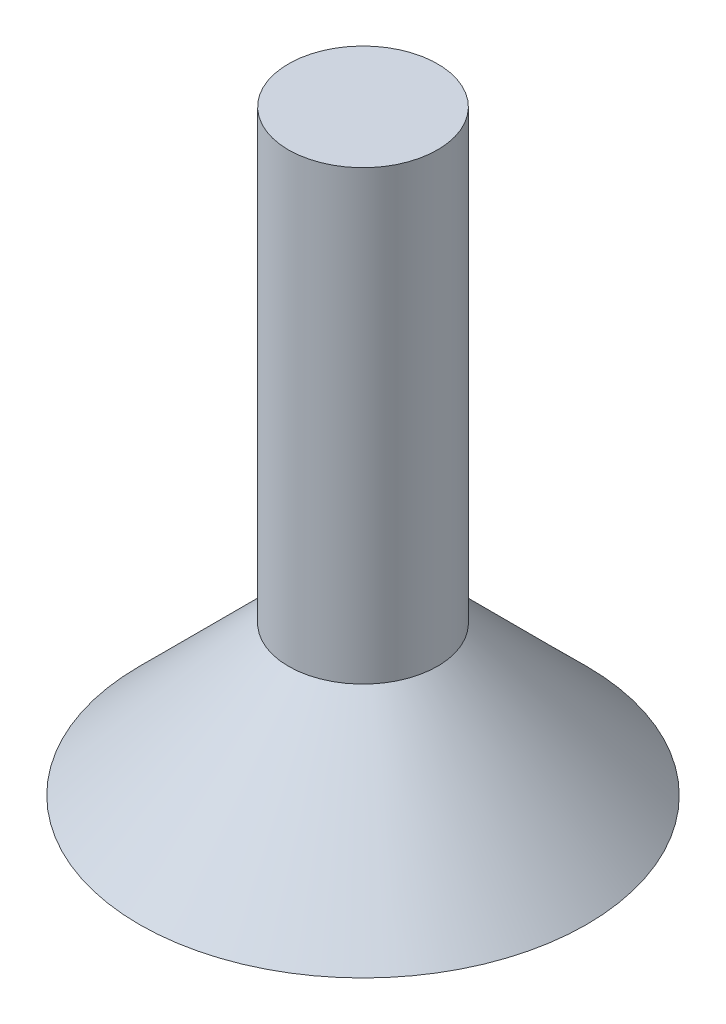
ISO-10303-21;
HEADER;
FILE_DESCRIPTION(('STEP AP214'),'2;1');
FILE_NAME('part.step','',(''),(''),'','','');
FILE_SCHEMA(('AUTOMOTIVE_DESIGN { 1 0 10303 214 1 1 1 1 }'));
ENDSEC;
DATA;
#1=APPLICATION_CONTEXT('core data for automotive mechanical design processes');
#2=APPLICATION_PROTOCOL_DEFINITION('international standard','automotive_design',2000,#1);
#3=PRODUCT_CONTEXT('',#1,'mechanical');
#4=PRODUCT('Part','Part','',(#3));
#5=PRODUCT_RELATED_PRODUCT_CATEGORY('part','',(#4));
#6=PRODUCT_DEFINITION_FORMATION('','',#4);
#7=PRODUCT_DEFINITION_CONTEXT('part definition',#1,'design');
#8=PRODUCT_DEFINITION('design','',#6,#7);
#9=PRODUCT_DEFINITION_SHAPE('','',#8);
#10=(LENGTH_UNIT() NAMED_UNIT(*) SI_UNIT(.MILLI.,.METRE.));
#11=(NAMED_UNIT(*) PLANE_ANGLE_UNIT() SI_UNIT($,.RADIAN.));
#12=(NAMED_UNIT(*) SI_UNIT($,.STERADIAN.) SOLID_ANGLE_UNIT());
#13=UNCERTAINTY_MEASURE_WITH_UNIT(LENGTH_MEASURE(1.E-05),#10,'distance_accuracy_value','');
#14=(GEOMETRIC_REPRESENTATION_CONTEXT(3) GLOBAL_UNCERTAINTY_ASSIGNED_CONTEXT((#13)) GLOBAL_UNIT_ASSIGNED_CONTEXT((#10,
#11,#12)) REPRESENTATION_CONTEXT('',''));
#15=CARTESIAN_POINT('',(0.,0.,0.));
#16=DIRECTION('',(0.,0.,1.));
#17=DIRECTION('',(1.,0.,0.));
#18=AXIS2_PLACEMENT_3D('',#15,#16,#17);
#19=CARTESIAN_POINT('',(0.,40.,0.));
#20=DIRECTION('',(0.,-1.,0.));
#21=DIRECTION('',(0.,0.,-1.));
#22=AXIS2_PLACEMENT_3D('',#19,#20,#21);
#23=PLANE('',#22);
#24=CARTESIAN_POINT('',(0.,40.,0.));
#25=DIRECTION('',(0.,1.,0.));
#26=DIRECTION('',(0.,0.,1.));
#27=AXIS2_PLACEMENT_3D('',#24,#25,#26);
#28=CIRCLE('',#27,5.);
#29=CARTESIAN_POINT('',(0.,40.,5.));
#30=VERTEX_POINT('',#29);
#31=EDGE_CURVE('E10',#30,#30,#28,.T.);
#32=ORIENTED_EDGE('',*,*,#31,.T.);
#33=EDGE_LOOP('',(#32));
#34=FACE_BOUND('',#33,.T.);
#35=ADVANCED_FACE('F40',(#34),#23,.F.);
#36=CARTESIAN_POINT('',(0.,40.,0.));
#37=DIRECTION('',(0.,1.,0.));
#38=DIRECTION('',(0.,0.,1.));
#39=AXIS2_PLACEMENT_3D('',#36,#37,#38);
#40=CYLINDRICAL_SURFACE('',#39,5.);
#41=ORIENTED_EDGE('',*,*,#31,.F.);
#42=EDGE_LOOP('',(#41));
#43=FACE_BOUND('',#42,.T.);
#44=CARTESIAN_POINT('',(0.,10.,0.));
#45=DIRECTION('',(0.,1.,0.));
#46=DIRECTION('',(0.,0.,1.));
#47=AXIS2_PLACEMENT_3D('',#44,#45,#46);
#48=CIRCLE('',#47,5.00000000000001);
#49=CARTESIAN_POINT('',(0.,10.,5.00000000000001));
#50=VERTEX_POINT('',#49);
#51=EDGE_CURVE('E46',#50,#50,#48,.T.);
#52=ORIENTED_EDGE('',*,*,#51,.T.);
#53=EDGE_LOOP('',(#52));
#54=FACE_BOUND('',#53,.T.);
#55=ADVANCED_FACE('F65',(#43,#54),#40,.T.);
#56=CARTESIAN_POINT('',(0.,0.,0.));
#57=DIRECTION('',(0.,-1.,0.));
#58=DIRECTION('',(0.,0.,-1.));
#59=AXIS2_PLACEMENT_3D('',#56,#57,#58);
#60=CONICAL_SURFACE('',#59,15.,0.785398163397447);
#61=ORIENTED_EDGE('',*,*,#51,.F.);
#62=EDGE_LOOP('',(#61));
#63=FACE_BOUND('',#62,.T.);
#64=CARTESIAN_POINT('',(0.,0.,0.));
#65=DIRECTION('',(0.,1.,0.));
#66=DIRECTION('',(0.,0.,1.));
#67=AXIS2_PLACEMENT_3D('',#64,#65,#66);
#68=CIRCLE('',#67,15.);
#69=CARTESIAN_POINT('',(0.,0.,15.));
#70=VERTEX_POINT('',#69);
#71=EDGE_CURVE('E50',#70,#70,#68,.T.);
#72=ORIENTED_EDGE('',*,*,#71,.T.);
#73=EDGE_LOOP('',(#72));
#74=FACE_BOUND('',#73,.T.);
#75=ADVANCED_FACE('F57',(#63,#74),#60,.T.);
#76=CARTESIAN_POINT('',(0.,0.,0.));
#77=DIRECTION('',(0.,1.,0.));
#78=DIRECTION('',(0.,0.,1.));
#79=AXIS2_PLACEMENT_3D('',#76,#77,#78);
#80=PLANE('',#79);
#81=ORIENTED_EDGE('',*,*,#71,.F.);
#82=EDGE_LOOP('',(#81));
#83=FACE_BOUND('',#82,.T.);
#84=ADVANCED_FACE('F59',(#83),#80,.F.);
#85=CLOSED_SHELL('',(#35,#55,#75,#84));
#86=MANIFOLD_SOLID_BREP('B2',#85);
#87=ADVANCED_BREP_SHAPE_REPRESENTATION('',(#18,#86),#14);
#88=SHAPE_DEFINITION_REPRESENTATION(#9,#87);
ENDSEC;
END-ISO-10303-21;
